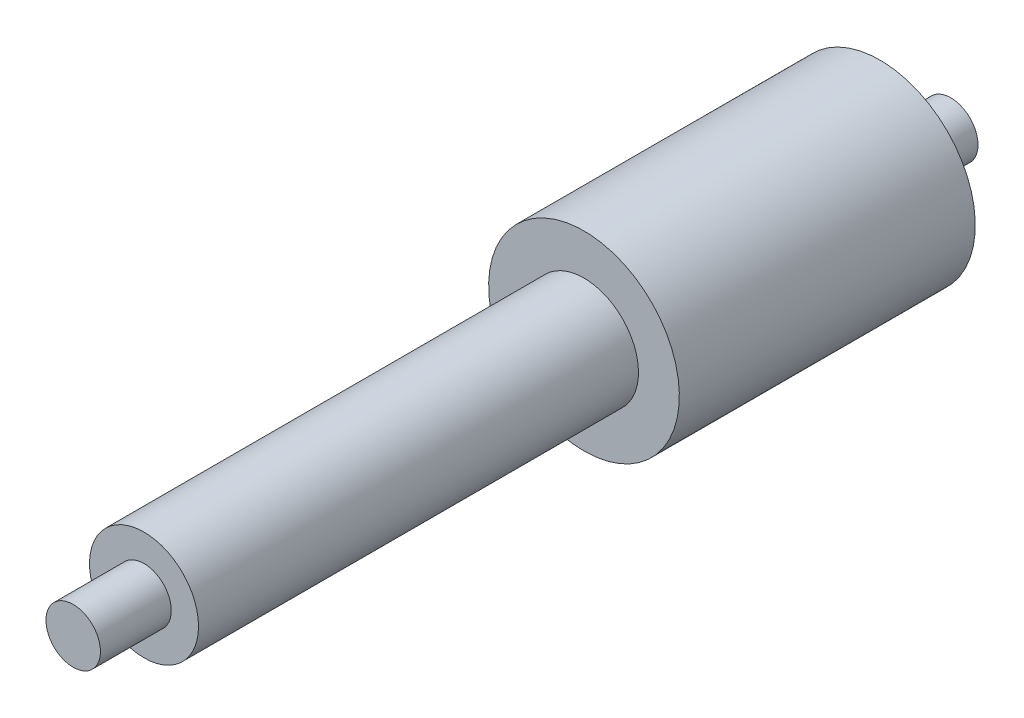
ISO-10303-21;
HEADER;
FILE_DESCRIPTION(('STEP AP214'),'2;1');
FILE_NAME('part.step','',(''),(''),'','','');
FILE_SCHEMA(('AUTOMOTIVE_DESIGN { 1 0 10303 214 1 1 1 1 }'));
ENDSEC;
DATA;
#1=APPLICATION_CONTEXT('core data for automotive mechanical design processes');
#2=APPLICATION_PROTOCOL_DEFINITION('international standard','automotive_design',2000,#1);
#3=PRODUCT_CONTEXT('',#1,'mechanical');
#4=PRODUCT('Part','Part','',(#3));
#5=PRODUCT_RELATED_PRODUCT_CATEGORY('part','',(#4));
#6=PRODUCT_DEFINITION_FORMATION('','',#4);
#7=PRODUCT_DEFINITION_CONTEXT('part definition',#1,'design');
#8=PRODUCT_DEFINITION('design','',#6,#7);
#9=PRODUCT_DEFINITION_SHAPE('','',#8);
#10=(LENGTH_UNIT() NAMED_UNIT(*) SI_UNIT(.MILLI.,.METRE.));
#11=(NAMED_UNIT(*) PLANE_ANGLE_UNIT() SI_UNIT($,.RADIAN.));
#12=(NAMED_UNIT(*) SI_UNIT($,.STERADIAN.) SOLID_ANGLE_UNIT());
#13=UNCERTAINTY_MEASURE_WITH_UNIT(LENGTH_MEASURE(1.E-05),#10,'distance_accuracy_value','');
#14=(GEOMETRIC_REPRESENTATION_CONTEXT(3) GLOBAL_UNCERTAINTY_ASSIGNED_CONTEXT((#13)) GLOBAL_UNIT_ASSIGNED_CONTEXT((#10,
#11,#12)) REPRESENTATION_CONTEXT('',''));
#15=CARTESIAN_POINT('',(0.,0.,0.));
#16=DIRECTION('',(0.,0.,1.));
#17=DIRECTION('',(1.,0.,0.));
#18=AXIS2_PLACEMENT_3D('',#15,#16,#17);
#19=CARTESIAN_POINT('',(0.,0.,30.4000000000018));
#20=DIRECTION('',(0.,0.,1.));
#21=DIRECTION('',(0.999615906052978,-0.0277135412007221,0.));
#22=AXIS2_PLACEMENT_3D('',#19,#20,#21);
#23=PLANE('',#22);
#24=CARTESIAN_POINT('',(0.,0.,30.4000000000018));
#25=DIRECTION('',(0.,0.,1.));
#26=DIRECTION('',(1.,0.,0.));
#27=AXIS2_PLACEMENT_3D('',#24,#25,#26);
#28=CIRCLE('',#27,1.);
#29=CARTESIAN_POINT('',(1.,0.,30.4000000000018));
#30=VERTEX_POINT('',#29);
#31=EDGE_CURVE('E48',#30,#30,#28,.T.);
#32=ORIENTED_EDGE('',*,*,#31,.F.);
#33=EDGE_LOOP('',(#32));
#34=FACE_BOUND('',#33,.T.);
#35=CARTESIAN_POINT('',(0.,0.,30.4000000000018));
#36=DIRECTION('',(0.,0.,1.));
#37=DIRECTION('',(1.,0.,0.));
#38=AXIS2_PLACEMENT_3D('',#35,#36,#37);
#39=CIRCLE('',#38,2.);
#40=CARTESIAN_POINT('',(2.,0.,30.4000000000018));
#41=VERTEX_POINT('',#40);
#42=EDGE_CURVE('E56',#41,#41,#39,.F.);
#43=ORIENTED_EDGE('',*,*,#42,.F.);
#44=EDGE_LOOP('',(#43));
#45=FACE_BOUND('',#44,.T.);
#46=ADVANCED_FACE('F37',(#34,#45),#23,.T.);
#47=CARTESIAN_POINT('',(0.,0.,36.0568542494941));
#48=DIRECTION('',(0.,0.,-1.));
#49=DIRECTION('',(-1.,0.,0.));
#50=AXIS2_PLACEMENT_3D('',#47,#48,#49);
#51=CYLINDRICAL_SURFACE('',#50,2.);
#52=CARTESIAN_POINT('',(0.,0.,14.2500000000015));
#53=DIRECTION('',(0.,0.,1.));
#54=DIRECTION('',(0.,-1.,0.));
#55=AXIS2_PLACEMENT_3D('',#52,#53,#54);
#56=CIRCLE('',#55,2.);
#57=CARTESIAN_POINT('',(0.,-2.,14.2500000000015));
#58=VERTEX_POINT('',#57);
#59=EDGE_CURVE('E10',#58,#58,#56,.F.);
#60=ORIENTED_EDGE('',*,*,#59,.F.);
#61=EDGE_LOOP('',(#60));
#62=FACE_BOUND('',#61,.T.);
#63=ORIENTED_EDGE('',*,*,#42,.T.);
#64=EDGE_LOOP('',(#63));
#65=FACE_BOUND('',#64,.T.);
#66=ADVANCED_FACE('F71',(#62,#65),#51,.T.);
#67=CARTESIAN_POINT('',(0.,0.,35.828427124748));
#68=DIRECTION('',(0.,0.,-1.));
#69=DIRECTION('',(-1.,0.,0.));
#70=AXIS2_PLACEMENT_3D('',#67,#68,#69);
#71=CYLINDRICAL_SURFACE('',#70,1.);
#72=ORIENTED_EDGE('',*,*,#31,.T.);
#73=EDGE_LOOP('',(#72));
#74=FACE_BOUND('',#73,.T.);
#75=CARTESIAN_POINT('',(0.,0.,33.0000000000018));
#76=DIRECTION('',(0.,0.,1.));
#77=DIRECTION('',(1.,0.,0.));
#78=AXIS2_PLACEMENT_3D('',#75,#76,#77);
#79=CIRCLE('',#78,1.);
#80=CARTESIAN_POINT('',(1.,0.,33.0000000000018));
#81=VERTEX_POINT('',#80);
#82=EDGE_CURVE('E64',#81,#81,#79,.T.);
#83=ORIENTED_EDGE('',*,*,#82,.F.);
#84=EDGE_LOOP('',(#83));
#85=FACE_BOUND('',#84,.T.);
#86=ADVANCED_FACE('F78',(#74,#85),#71,.T.);
#87=CARTESIAN_POINT('',(-48.5153507489251,-26.,33.0000000000018));
#88=DIRECTION('',(0.,0.,1.));
#89=DIRECTION('',(1.,0.,0.));
#90=AXIS2_PLACEMENT_3D('',#87,#88,#89);
#91=PLANE('',#90);
#92=ORIENTED_EDGE('',*,*,#82,.T.);
#93=EDGE_LOOP('',(#92));
#94=FACE_BOUND('',#93,.T.);
#95=ADVANCED_FACE('F84',(#94),#91,.T.);
#96=CARTESIAN_POINT('',(0.,0.,14.2500000000015));
#97=DIRECTION('',(0.,0.,1.));
#98=DIRECTION('',(0.,-1.,0.));
#99=AXIS2_PLACEMENT_3D('',#96,#97,#98);
#100=PLANE('',#99);
#101=ORIENTED_EDGE('',*,*,#59,.T.);
#102=EDGE_LOOP('',(#101));
#103=FACE_BOUND('',#102,.T.);
#104=CARTESIAN_POINT('',(0.,0.,14.2500000000015));
#105=DIRECTION('',(0.,0.,1.));
#106=DIRECTION('',(0.,-1.,0.));
#107=AXIS2_PLACEMENT_3D('',#104,#105,#106);
#108=CIRCLE('',#107,3.5);
#109=CARTESIAN_POINT('',(0.,-3.5,14.2500000000015));
#110=VERTEX_POINT('',#109);
#111=EDGE_CURVE('E111',#110,#110,#108,.T.);
#112=ORIENTED_EDGE('',*,*,#111,.T.);
#113=EDGE_LOOP('',(#112));
#114=FACE_BOUND('',#113,.T.);
#115=ADVANCED_FACE('F89',(#103,#114),#100,.T.);
#116=CARTESIAN_POINT('',(0.,0.,-6.51303264796996));
#117=DIRECTION('',(0.,0.,1.));
#118=DIRECTION('',(1.,0.,0.));
#119=AXIS2_PLACEMENT_3D('',#116,#117,#118);
#120=CYLINDRICAL_SURFACE('',#119,3.5);
#121=ORIENTED_EDGE('',*,*,#111,.F.);
#122=EDGE_LOOP('',(#121));
#123=FACE_BOUND('',#122,.T.);
#124=CARTESIAN_POINT('',(0.,0.,3.38646228864161));
#125=DIRECTION('',(0.,0.,-0.999999999999995));
#126=DIRECTION('',(-1.,0.,0.));
#127=AXIS2_PLACEMENT_3D('',#124,#125,#126);
#128=CIRCLE('',#127,3.5);
#129=CARTESIAN_POINT('',(-3.5,0.,3.3864622886416));
#130=VERTEX_POINT('',#129);
#131=EDGE_CURVE('E60',#130,#130,#128,.F.);
#132=ORIENTED_EDGE('',*,*,#131,.T.);
#133=EDGE_LOOP('',(#132));
#134=FACE_BOUND('',#133,.T.);
#135=ADVANCED_FACE('F94',(#123,#134),#120,.T.);
#136=CARTESIAN_POINT('',(-48.5153507489251,-26.,0.786462288641605));
#137=DIRECTION('',(0.,0.,1.));
#138=DIRECTION('',(1.,0.,0.));
#139=AXIS2_PLACEMENT_3D('',#136,#137,#138);
#140=PLANE('',#139);
#141=CARTESIAN_POINT('',(0.,0.,0.786462288641605));
#142=DIRECTION('',(0.,0.,1.));
#143=DIRECTION('',(1.,0.,0.));
#144=AXIS2_PLACEMENT_3D('',#141,#142,#143);
#145=CIRCLE('',#144,1.);
#146=CARTESIAN_POINT('',(1.,0.,0.786462288641605));
#147=VERTEX_POINT('',#146);
#148=EDGE_CURVE('E62',#147,#147,#145,.T.);
#149=ORIENTED_EDGE('',*,*,#148,.F.);
#150=EDGE_LOOP('',(#149));
#151=FACE_BOUND('',#150,.T.);
#152=ADVANCED_FACE('F105',(#151),#140,.F.);
#153=CARTESIAN_POINT('',(0.,0.,-2.04196483610459));
#154=DIRECTION('',(0.,0.,1.));
#155=DIRECTION('',(1.,0.,0.));
#156=AXIS2_PLACEMENT_3D('',#153,#154,#155);
#157=CYLINDRICAL_SURFACE('',#156,1.);
#158=ORIENTED_EDGE('',*,*,#148,.T.);
#159=EDGE_LOOP('',(#158));
#160=FACE_BOUND('',#159,.T.);
#161=CARTESIAN_POINT('',(0.,0.,3.38646228864161));
#162=DIRECTION('',(0.,0.,-1.));
#163=DIRECTION('',(-1.,0.,0.));
#164=AXIS2_PLACEMENT_3D('',#161,#162,#163);
#165=CIRCLE('',#164,1.);
#166=CARTESIAN_POINT('',(-1.,0.,3.38646228864161));
#167=VERTEX_POINT('',#166);
#168=EDGE_CURVE('E43',#167,#167,#165,.T.);
#169=ORIENTED_EDGE('',*,*,#168,.T.);
#170=EDGE_LOOP('',(#169));
#171=FACE_BOUND('',#170,.T.);
#172=ADVANCED_FACE('F100',(#160,#171),#157,.T.);
#173=CARTESIAN_POINT('',(0.,0.,3.38646228864161));
#174=DIRECTION('',(0.,0.,-1.));
#175=DIRECTION('',(-1.,0.,0.));
#176=AXIS2_PLACEMENT_3D('',#173,#174,#175);
#177=PLANE('',#176);
#178=ORIENTED_EDGE('',*,*,#168,.F.);
#179=EDGE_LOOP('',(#178));
#180=FACE_BOUND('',#179,.T.);
#181=ORIENTED_EDGE('',*,*,#131,.F.);
#182=EDGE_LOOP('',(#181));
#183=FACE_BOUND('',#182,.T.);
#184=ADVANCED_FACE('F98',(#180,#183),#177,.T.);
#185=CLOSED_SHELL('',(#46,#66,#86,#95,#115,#135,#152,#172,#184));
#186=MANIFOLD_SOLID_BREP('B2',#185);
#187=ADVANCED_BREP_SHAPE_REPRESENTATION('',(#18,#186),#14);
#188=SHAPE_DEFINITION_REPRESENTATION(#9,#187);
ENDSEC;
END-ISO-10303-21;
